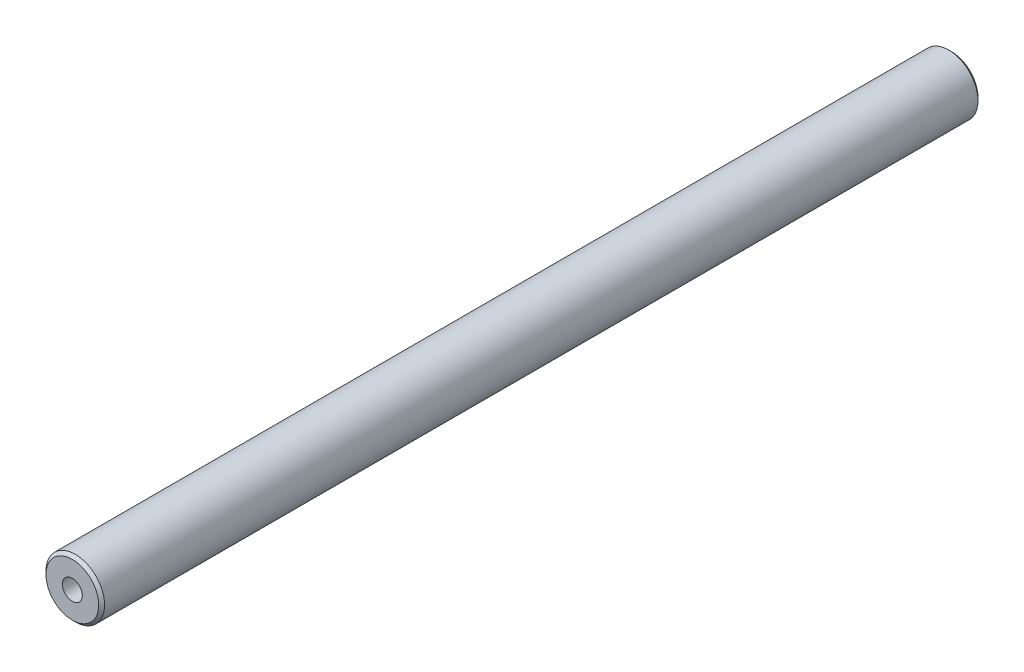
ISO-10303-21;
HEADER;
FILE_DESCRIPTION(('STEP AP214'),'2;1');
FILE_NAME('part.step','',(''),(''),'','','');
FILE_SCHEMA(('AUTOMOTIVE_DESIGN { 1 0 10303 214 1 1 1 1 }'));
ENDSEC;
DATA;
#1=APPLICATION_CONTEXT('core data for automotive mechanical design processes');
#2=APPLICATION_PROTOCOL_DEFINITION('international standard','automotive_design',2000,#1);
#3=PRODUCT_CONTEXT('',#1,'mechanical');
#4=PRODUCT('Part','Part','',(#3));
#5=PRODUCT_RELATED_PRODUCT_CATEGORY('part','',(#4));
#6=PRODUCT_DEFINITION_FORMATION('','',#4);
#7=PRODUCT_DEFINITION_CONTEXT('part definition',#1,'design');
#8=PRODUCT_DEFINITION('design','',#6,#7);
#9=PRODUCT_DEFINITION_SHAPE('','',#8);
#10=(LENGTH_UNIT() NAMED_UNIT(*) SI_UNIT(.MILLI.,.METRE.));
#11=(NAMED_UNIT(*) PLANE_ANGLE_UNIT() SI_UNIT($,.RADIAN.));
#12=(NAMED_UNIT(*) SI_UNIT($,.STERADIAN.) SOLID_ANGLE_UNIT());
#13=UNCERTAINTY_MEASURE_WITH_UNIT(LENGTH_MEASURE(1.E-05),#10,'distance_accuracy_value','');
#14=(GEOMETRIC_REPRESENTATION_CONTEXT(3) GLOBAL_UNCERTAINTY_ASSIGNED_CONTEXT((#13)) GLOBAL_UNIT_ASSIGNED_CONTEXT((#10,
#11,#12)) REPRESENTATION_CONTEXT('',''));
#15=CARTESIAN_POINT('',(0.,0.,0.));
#16=DIRECTION('',(0.,0.,1.));
#17=DIRECTION('',(1.,0.,0.));
#18=AXIS2_PLACEMENT_3D('',#15,#16,#17);
#19=CARTESIAN_POINT('',(0.,0.,150.));
#20=DIRECTION('',(0.,0.,-1.));
#21=DIRECTION('',(-1.,0.,0.));
#22=AXIS2_PLACEMENT_3D('',#19,#20,#21);
#23=CYLINDRICAL_SURFACE('',#22,10.);
#24=CARTESIAN_POINT('',(0.,0.,-149.));
#25=DIRECTION('',(0.,0.,1.));
#26=DIRECTION('',(1.,0.,0.));
#27=AXIS2_PLACEMENT_3D('',#24,#25,#26);
#28=CIRCLE('',#27,10.);
#29=CARTESIAN_POINT('',(10.,0.,-149.));
#30=VERTEX_POINT('',#29);
#31=EDGE_CURVE('E68',#30,#30,#28,.T.);
#32=ORIENTED_EDGE('',*,*,#31,.T.);
#33=EDGE_LOOP('',(#32));
#34=FACE_BOUND('',#33,.T.);
#35=CARTESIAN_POINT('',(0.,0.,149.));
#36=DIRECTION('',(0.,0.,1.));
#37=DIRECTION('',(1.,0.,0.));
#38=AXIS2_PLACEMENT_3D('',#35,#36,#37);
#39=CIRCLE('',#38,10.);
#40=CARTESIAN_POINT('',(10.,0.,149.));
#41=VERTEX_POINT('',#40);
#42=EDGE_CURVE('E64',#41,#41,#39,.F.);
#43=ORIENTED_EDGE('',*,*,#42,.T.);
#44=EDGE_LOOP('',(#43));
#45=FACE_BOUND('',#44,.T.);
#46=ADVANCED_FACE('F43',(#34,#45),#23,.T.);
#47=CARTESIAN_POINT('',(0.,0.,150.));
#48=DIRECTION('',(0.,0.,1.));
#49=DIRECTION('',(1.,0.,0.));
#50=AXIS2_PLACEMENT_3D('',#47,#48,#49);
#51=PLANE('',#50);
#52=CARTESIAN_POINT('',(0.,0.,150.));
#53=DIRECTION('',(0.,0.,1.));
#54=DIRECTION('',(1.,0.,0.));
#55=AXIS2_PLACEMENT_3D('',#52,#53,#54);
#56=CIRCLE('',#55,9.00000000000004);
#57=CARTESIAN_POINT('',(9.00000000000004,0.,150.));
#58=VERTEX_POINT('',#57);
#59=EDGE_CURVE('E11',#58,#58,#56,.T.);
#60=ORIENTED_EDGE('',*,*,#59,.T.);
#61=EDGE_LOOP('',(#60));
#62=FACE_BOUND('',#61,.T.);
#63=CARTESIAN_POINT('',(0.,0.,150.));
#64=DIRECTION('',(0.,0.,1.));
#65=DIRECTION('',(1.,0.,0.));
#66=AXIS2_PLACEMENT_3D('',#63,#64,#65);
#67=CIRCLE('',#66,3.39999999999999);
#68=CARTESIAN_POINT('',(3.39999999999999,0.,150.));
#69=VERTEX_POINT('',#68);
#70=EDGE_CURVE('E65',#69,#69,#67,.T.);
#71=ORIENTED_EDGE('',*,*,#70,.F.);
#72=EDGE_LOOP('',(#71));
#73=FACE_BOUND('',#72,.T.);
#74=ADVANCED_FACE('F85',(#62,#73),#51,.T.);
#75=CARTESIAN_POINT('',(0.,0.,-150.));
#76=DIRECTION('',(0.,0.,1.));
#77=DIRECTION('',(1.,0.,0.));
#78=AXIS2_PLACEMENT_3D('',#75,#76,#77);
#79=PLANE('',#78);
#80=CARTESIAN_POINT('',(0.,0.,-150.));
#81=DIRECTION('',(0.,0.,1.));
#82=DIRECTION('',(1.,0.,0.));
#83=AXIS2_PLACEMENT_3D('',#80,#81,#82);
#84=CIRCLE('',#83,8.99999999999995);
#85=CARTESIAN_POINT('',(8.99999999999995,0.,-150.));
#86=VERTEX_POINT('',#85);
#87=EDGE_CURVE('E51',#86,#86,#84,.F.);
#88=ORIENTED_EDGE('',*,*,#87,.T.);
#89=EDGE_LOOP('',(#88));
#90=FACE_BOUND('',#89,.T.);
#91=ADVANCED_FACE('F58',(#90),#79,.F.);
#92=CARTESIAN_POINT('',(0.,0.,130.25));
#93=DIRECTION('',(0.,0.,1.));
#94=DIRECTION('',(1.,0.,0.));
#95=AXIS2_PLACEMENT_3D('',#92,#93,#94);
#96=CONICAL_SURFACE('',#95,3.39999999999999,1.02974425867665);
#97=CARTESIAN_POINT('',(0.,0.,128.207073895306));
#98=VERTEX_POINT('',#97);
#99=VERTEX_LOOP('',#98);
#100=FACE_BOUND('',#99,.T.);
#101=CARTESIAN_POINT('',(0.,0.,130.25));
#102=DIRECTION('',(0.,0.,1.));
#103=DIRECTION('',(1.,0.,0.));
#104=AXIS2_PLACEMENT_3D('',#101,#102,#103);
#105=CIRCLE('',#104,3.39999999999999);
#106=CARTESIAN_POINT('',(3.39999999999999,0.,130.25));
#107=VERTEX_POINT('',#106);
#108=EDGE_CURVE('E62',#107,#107,#105,.T.);
#109=ORIENTED_EDGE('',*,*,#108,.T.);
#110=EDGE_LOOP('',(#109));
#111=FACE_BOUND('',#110,.T.);
#112=ADVANCED_FACE('F54',(#100,#111),#96,.F.);
#113=CARTESIAN_POINT('',(0.,0.,150.));
#114=DIRECTION('',(0.,0.,1.));
#115=DIRECTION('',(1.,0.,0.));
#116=AXIS2_PLACEMENT_3D('',#113,#114,#115);
#117=CYLINDRICAL_SURFACE('',#116,3.39999999999999);
#118=ORIENTED_EDGE('',*,*,#108,.F.);
#119=EDGE_LOOP('',(#118));
#120=FACE_BOUND('',#119,.T.);
#121=ORIENTED_EDGE('',*,*,#70,.T.);
#122=EDGE_LOOP('',(#121));
#123=FACE_BOUND('',#122,.T.);
#124=ADVANCED_FACE('F57',(#120,#123),#117,.F.);
#125=CARTESIAN_POINT('',(0.,0.,-149.));
#126=DIRECTION('',(0.,0.,1.));
#127=DIRECTION('',(1.,0.,0.));
#128=AXIS2_PLACEMENT_3D('',#125,#126,#127);
#129=CONICAL_SURFACE('',#128,10.,0.785398163397443);
#130=ORIENTED_EDGE('',*,*,#87,.F.);
#131=EDGE_LOOP('',(#130));
#132=FACE_BOUND('',#131,.T.);
#133=ORIENTED_EDGE('',*,*,#31,.F.);
#134=EDGE_LOOP('',(#133));
#135=FACE_BOUND('',#134,.T.);
#136=ADVANCED_FACE('F78',(#132,#135),#129,.T.);
#137=CARTESIAN_POINT('',(0.,0.,150.));
#138=DIRECTION('',(0.,0.,-1.));
#139=DIRECTION('',(-1.,0.,0.));
#140=AXIS2_PLACEMENT_3D('',#137,#138,#139);
#141=CONICAL_SURFACE('',#140,9.00000000000004,0.785398163397443);
#142=ORIENTED_EDGE('',*,*,#42,.F.);
#143=EDGE_LOOP('',(#142));
#144=FACE_BOUND('',#143,.T.);
#145=ORIENTED_EDGE('',*,*,#59,.F.);
#146=EDGE_LOOP('',(#145));
#147=FACE_BOUND('',#146,.T.);
#148=ADVANCED_FACE('F46',(#144,#147),#141,.T.);
#149=CLOSED_SHELL('',(#46,#74,#91,#112,#124,#136,#148));
#150=MANIFOLD_SOLID_BREP('B2',#149);
#151=ADVANCED_BREP_SHAPE_REPRESENTATION('',(#18,#150),#14);
#152=SHAPE_DEFINITION_REPRESENTATION(#9,#151);
ENDSEC;
END-ISO-10303-21;
